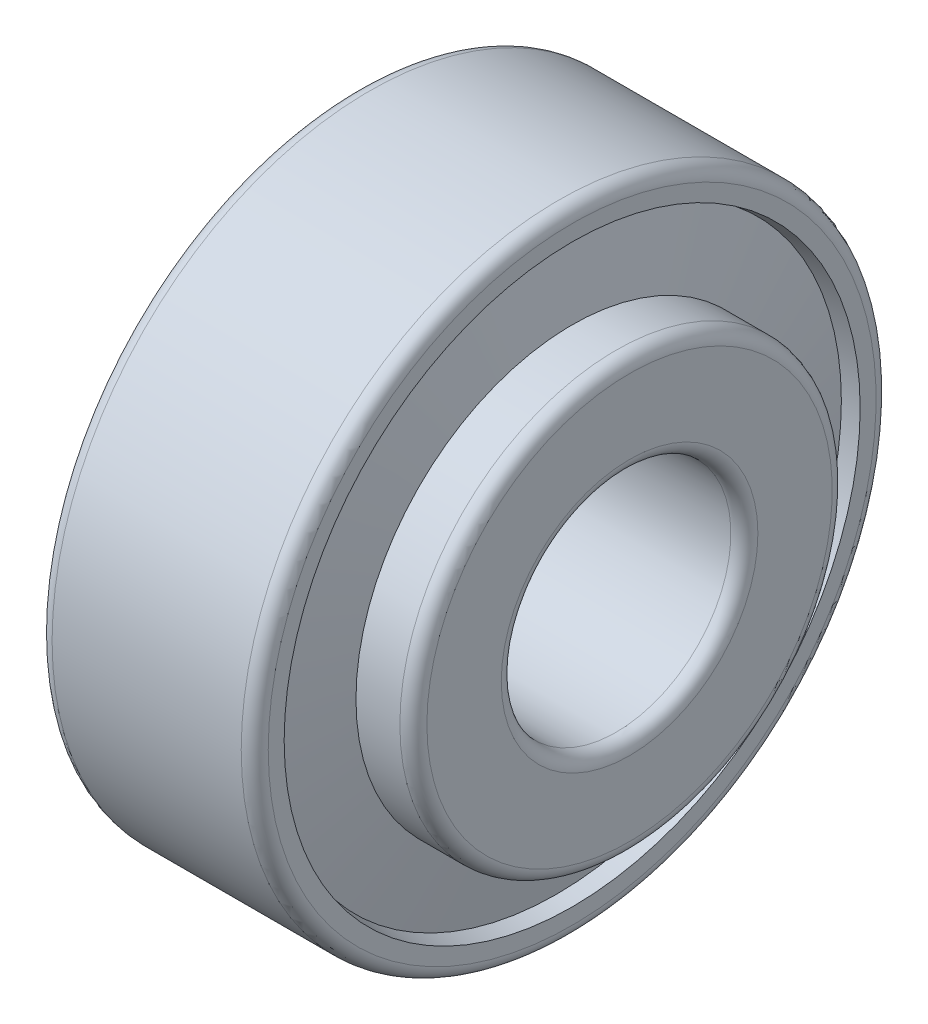
ISO-10303-21;
HEADER;
FILE_DESCRIPTION(('STEP AP214'),'2;1');
FILE_NAME('part.step','',(''),(''),'','','');
FILE_SCHEMA(('AUTOMOTIVE_DESIGN { 1 0 10303 214 1 1 1 1 }'));
ENDSEC;
DATA;
#1=APPLICATION_CONTEXT('core data for automotive mechanical design processes');
#2=APPLICATION_PROTOCOL_DEFINITION('international standard','automotive_design',2000,#1);
#3=PRODUCT_CONTEXT('',#1,'mechanical');
#4=PRODUCT('Part','Part','',(#3));
#5=PRODUCT_RELATED_PRODUCT_CATEGORY('part','',(#4));
#6=PRODUCT_DEFINITION_FORMATION('','',#4);
#7=PRODUCT_DEFINITION_CONTEXT('part definition',#1,'design');
#8=PRODUCT_DEFINITION('design','',#6,#7);
#9=PRODUCT_DEFINITION_SHAPE('','',#8);
#10=(LENGTH_UNIT() NAMED_UNIT(*) SI_UNIT(.MILLI.,.METRE.));
#11=(NAMED_UNIT(*) PLANE_ANGLE_UNIT() SI_UNIT($,.RADIAN.));
#12=(NAMED_UNIT(*) SI_UNIT($,.STERADIAN.) SOLID_ANGLE_UNIT());
#13=UNCERTAINTY_MEASURE_WITH_UNIT(LENGTH_MEASURE(1.E-05),#10,'distance_accuracy_value','');
#14=(GEOMETRIC_REPRESENTATION_CONTEXT(3) GLOBAL_UNCERTAINTY_ASSIGNED_CONTEXT((#13)) GLOBAL_UNIT_ASSIGNED_CONTEXT((#10,
#11,#12)) REPRESENTATION_CONTEXT('',''));
#15=CARTESIAN_POINT('',(0.,0.,0.));
#16=DIRECTION('',(0.,0.,1.));
#17=DIRECTION('',(1.,0.,0.));
#18=AXIS2_PLACEMENT_3D('',#15,#16,#17);
#19=CARTESIAN_POINT('',(2.33736788502514,0.,0.));
#20=DIRECTION('',(-1.,0.,0.));
#21=DIRECTION('',(0.,0.,1.));
#22=AXIS2_PLACEMENT_3D('',#19,#20,#21);
#23=CONICAL_SURFACE('',#22,18.5235776613116,1.38303283623799);
#24=CARTESIAN_POINT('',(3.4247357700502,0.,0.));
#25=DIRECTION('',(-1.,0.,0.));
#26=DIRECTION('',(0.,0.,1.));
#27=AXIS2_PLACEMENT_3D('',#24,#25,#26);
#28=CIRCLE('',#27,12.8006369794296);
#29=CARTESIAN_POINT('',(3.4247357700502,0.,12.8006369794296));
#30=VERTEX_POINT('',#29);
#31=EDGE_CURVE('E112',#30,#30,#28,.T.);
#32=ORIENTED_EDGE('',*,*,#31,.F.);
#33=EDGE_LOOP('',(#32));
#34=FACE_BOUND('',#33,.T.);
#35=CARTESIAN_POINT('',(2.33736788502514,0.,0.));
#36=DIRECTION('',(-1.,0.,0.));
#37=DIRECTION('',(0.,0.,1.));
#38=AXIS2_PLACEMENT_3D('',#35,#36,#37);
#39=CIRCLE('',#38,18.5235776613116);
#40=CARTESIAN_POINT('',(2.33736788502514,0.,18.5235776613116));
#41=VERTEX_POINT('',#40);
#42=EDGE_CURVE('E10',#41,#41,#39,.T.);
#43=ORIENTED_EDGE('',*,*,#42,.T.);
#44=EDGE_LOOP('',(#43));
#45=FACE_BOUND('',#44,.T.);
#46=ADVANCED_FACE('F37',(#34,#45),#23,.F.);
#47=CARTESIAN_POINT('',(0.,0.,0.));
#48=DIRECTION('',(1.,0.,0.));
#49=DIRECTION('',(0.,0.,-1.));
#50=AXIS2_PLACEMENT_3D('',#47,#48,#49);
#51=CONICAL_SURFACE('',#50,18.045,0.201959319208055);
#52=ORIENTED_EDGE('',*,*,#42,.F.);
#53=EDGE_LOOP('',(#52));
#54=FACE_BOUND('',#53,.T.);
#55=CARTESIAN_POINT('',(0.,0.,0.));
#56=DIRECTION('',(-1.,0.,0.));
#57=DIRECTION('',(0.,0.,1.));
#58=AXIS2_PLACEMENT_3D('',#55,#56,#57);
#59=CIRCLE('',#58,18.045);
#60=CARTESIAN_POINT('',(0.,0.,18.045));
#61=VERTEX_POINT('',#60);
#62=EDGE_CURVE('E44',#61,#61,#59,.T.);
#63=ORIENTED_EDGE('',*,*,#62,.T.);
#64=EDGE_LOOP('',(#63));
#65=FACE_BOUND('',#64,.T.);
#66=ADVANCED_FACE('F120',(#54,#65),#51,.F.);
#67=CARTESIAN_POINT('',(0.,18.045,0.));
#68=DIRECTION('',(1.,0.,0.));
#69=DIRECTION('',(0.,0.,-1.));
#70=AXIS2_PLACEMENT_3D('',#67,#68,#69);
#71=PLANE('',#70);
#72=ORIENTED_EDGE('',*,*,#62,.F.);
#73=EDGE_LOOP('',(#72));
#74=FACE_BOUND('',#73,.T.);
#75=CARTESIAN_POINT('',(0.,0.,0.));
#76=DIRECTION('',(-1.,0.,0.));
#77=DIRECTION('',(0.,0.,1.));
#78=AXIS2_PLACEMENT_3D('',#75,#76,#77);
#79=CIRCLE('',#78,22.5);
#80=CARTESIAN_POINT('',(0.,0.,22.5));
#81=VERTEX_POINT('',#80);
#82=EDGE_CURVE('E49',#81,#81,#79,.T.);
#83=ORIENTED_EDGE('',*,*,#82,.T.);
#84=EDGE_LOOP('',(#83));
#85=FACE_BOUND('',#84,.T.);
#86=ADVANCED_FACE('F124',(#74,#85),#71,.F.);
#87=CARTESIAN_POINT('',(1.,0.,0.));
#88=DIRECTION('',(-1.,0.,0.));
#89=DIRECTION('',(0.,0.,1.));
#90=AXIS2_PLACEMENT_3D('',#87,#88,#89);
#91=TOROIDAL_SURFACE('',#90,22.5,1.);
#92=ORIENTED_EDGE('',*,*,#82,.F.);
#93=EDGE_LOOP('',(#92));
#94=FACE_BOUND('',#93,.T.);
#95=CARTESIAN_POINT('',(1.,0.,0.));
#96=DIRECTION('',(-1.,0.,0.));
#97=DIRECTION('',(0.,0.,1.));
#98=AXIS2_PLACEMENT_3D('',#95,#96,#97);
#99=CIRCLE('',#98,23.5);
#100=CARTESIAN_POINT('',(1.,0.,23.5));
#101=VERTEX_POINT('',#100);
#102=EDGE_CURVE('E54',#101,#101,#99,.T.);
#103=ORIENTED_EDGE('',*,*,#102,.T.);
#104=EDGE_LOOP('',(#103));
#105=FACE_BOUND('',#104,.T.);
#106=ADVANCED_FACE('F129',(#94,#105),#91,.T.);
#107=CARTESIAN_POINT('',(-882.527700014444,0.,0.));
#108=DIRECTION('',(-1.,0.,0.));
#109=DIRECTION('',(0.,0.,1.));
#110=AXIS2_PLACEMENT_3D('',#107,#108,#109);
#111=CYLINDRICAL_SURFACE('',#110,23.5);
#112=ORIENTED_EDGE('',*,*,#102,.F.);
#113=EDGE_LOOP('',(#112));
#114=FACE_BOUND('',#113,.T.);
#115=CARTESIAN_POINT('',(15.,0.,0.));
#116=DIRECTION('',(-1.,0.,0.));
#117=DIRECTION('',(0.,0.,1.));
#118=AXIS2_PLACEMENT_3D('',#115,#116,#117);
#119=CIRCLE('',#118,23.5);
#120=CARTESIAN_POINT('',(15.,0.,23.5));
#121=VERTEX_POINT('',#120);
#122=EDGE_CURVE('E60',#121,#121,#119,.T.);
#123=ORIENTED_EDGE('',*,*,#122,.T.);
#124=EDGE_LOOP('',(#123));
#125=FACE_BOUND('',#124,.T.);
#126=ADVANCED_FACE('F135',(#114,#125),#111,.T.);
#127=CARTESIAN_POINT('',(15.,0.,0.));
#128=DIRECTION('',(-1.,0.,0.));
#129=DIRECTION('',(0.,0.,1.));
#130=AXIS2_PLACEMENT_3D('',#127,#128,#129);
#131=TOROIDAL_SURFACE('',#130,22.5,1.);
#132=ORIENTED_EDGE('',*,*,#122,.F.);
#133=EDGE_LOOP('',(#132));
#134=FACE_BOUND('',#133,.T.);
#135=CARTESIAN_POINT('',(16.,0.,0.));
#136=DIRECTION('',(-1.,0.,0.));
#137=DIRECTION('',(0.,0.,1.));
#138=AXIS2_PLACEMENT_3D('',#135,#136,#137);
#139=CIRCLE('',#138,22.5);
#140=CARTESIAN_POINT('',(16.,0.,22.5));
#141=VERTEX_POINT('',#140);
#142=EDGE_CURVE('E64',#141,#141,#139,.T.);
#143=ORIENTED_EDGE('',*,*,#142,.T.);
#144=EDGE_LOOP('',(#143));
#145=FACE_BOUND('',#144,.T.);
#146=ADVANCED_FACE('F139',(#134,#145),#131,.T.);
#147=CARTESIAN_POINT('',(16.,22.5,0.));
#148=DIRECTION('',(-1.,0.,0.));
#149=DIRECTION('',(0.,0.,1.));
#150=AXIS2_PLACEMENT_3D('',#147,#148,#149);
#151=PLANE('',#150);
#152=ORIENTED_EDGE('',*,*,#142,.F.);
#153=EDGE_LOOP('',(#152));
#154=FACE_BOUND('',#153,.T.);
#155=CARTESIAN_POINT('',(16.,0.,0.));
#156=DIRECTION('',(-1.,0.,0.));
#157=DIRECTION('',(0.,0.,1.));
#158=AXIS2_PLACEMENT_3D('',#155,#156,#157);
#159=CIRCLE('',#158,21.3210108624933);
#160=CARTESIAN_POINT('',(16.,0.,21.3210108624933));
#161=VERTEX_POINT('',#160);
#162=EDGE_CURVE('E68',#161,#161,#159,.T.);
#163=ORIENTED_EDGE('',*,*,#162,.T.);
#164=EDGE_LOOP('',(#163));
#165=FACE_BOUND('',#164,.T.);
#166=ADVANCED_FACE('F143',(#154,#165),#151,.F.);
#167=CARTESIAN_POINT('',(14.8449732976624,0.,0.));
#168=DIRECTION('',(1.,0.,0.));
#169=DIRECTION('',(0.,0.,-1.));
#170=AXIS2_PLACEMENT_3D('',#167,#168,#169);
#171=CONICAL_SURFACE('',#170,21.0845183610353,0.201959319208056);
#172=ORIENTED_EDGE('',*,*,#162,.F.);
#173=EDGE_LOOP('',(#172));
#174=FACE_BOUND('',#173,.T.);
#175=CARTESIAN_POINT('',(14.8449732976624,0.,0.));
#176=DIRECTION('',(-1.,0.,0.));
#177=DIRECTION('',(0.,0.,1.));
#178=AXIS2_PLACEMENT_3D('',#175,#176,#177);
#179=CIRCLE('',#178,21.0845183610353);
#180=CARTESIAN_POINT('',(14.8449732976624,0.,21.0845183610353));
#181=VERTEX_POINT('',#180);
#182=EDGE_CURVE('E72',#181,#181,#179,.T.);
#183=ORIENTED_EDGE('',*,*,#182,.T.);
#184=EDGE_LOOP('',(#183));
#185=FACE_BOUND('',#184,.T.);
#186=ADVANCED_FACE('F147',(#174,#185),#171,.F.);
#187=CARTESIAN_POINT('',(16.,0.,0.));
#188=DIRECTION('',(-1.,0.,0.));
#189=DIRECTION('',(0.,0.,1.));
#190=AXIS2_PLACEMENT_3D('',#187,#188,#189);
#191=CONICAL_SURFACE('',#190,15.0054816389647,1.38303283623799);
#192=ORIENTED_EDGE('',*,*,#182,.F.);
#193=EDGE_LOOP('',(#192));
#194=FACE_BOUND('',#193,.T.);
#195=CARTESIAN_POINT('',(16.,0.,0.));
#196=DIRECTION('',(-1.,0.,0.));
#197=DIRECTION('',(0.,0.,1.));
#198=AXIS2_PLACEMENT_3D('',#195,#196,#197);
#199=CIRCLE('',#198,15.0054816389647);
#200=CARTESIAN_POINT('',(16.,0.,15.0054816389647));
#201=VERTEX_POINT('',#200);
#202=EDGE_CURVE('E76',#201,#201,#199,.T.);
#203=ORIENTED_EDGE('',*,*,#202,.T.);
#204=EDGE_LOOP('',(#203));
#205=FACE_BOUND('',#204,.T.);
#206=ADVANCED_FACE('F151',(#194,#205),#191,.T.);
#207=CARTESIAN_POINT('',(16.,16.0054816389647,0.));
#208=DIRECTION('',(1.,0.,0.));
#209=DIRECTION('',(0.,0.,-1.));
#210=AXIS2_PLACEMENT_3D('',#207,#208,#209);
#211=PLANE('',#210);
#212=ORIENTED_EDGE('',*,*,#202,.F.);
#213=EDGE_LOOP('',(#212));
#214=FACE_BOUND('',#213,.T.);
#215=CARTESIAN_POINT('',(16.,0.,0.));
#216=DIRECTION('',(-1.,0.,0.));
#217=DIRECTION('',(0.,0.,1.));
#218=AXIS2_PLACEMENT_3D('',#215,#216,#217);
#219=CIRCLE('',#218,16.0054816389647);
#220=CARTESIAN_POINT('',(16.,0.,16.0054816389647));
#221=VERTEX_POINT('',#220);
#222=EDGE_CURVE('E80',#221,#221,#219,.T.);
#223=ORIENTED_EDGE('',*,*,#222,.T.);
#224=EDGE_LOOP('',(#223));
#225=FACE_BOUND('',#224,.T.);
#226=ADVANCED_FACE('F155',(#214,#225),#211,.F.);
#227=CARTESIAN_POINT('',(-882.527700014444,0.,0.));
#228=DIRECTION('',(-1.,0.,0.));
#229=DIRECTION('',(0.,0.,1.));
#230=AXIS2_PLACEMENT_3D('',#227,#228,#229);
#231=CYLINDRICAL_SURFACE('',#230,16.0054816389647);
#232=ORIENTED_EDGE('',*,*,#222,.F.);
#233=EDGE_LOOP('',(#232));
#234=FACE_BOUND('',#233,.T.);
#235=CARTESIAN_POINT('',(19.25,0.,0.));
#236=DIRECTION('',(-1.,0.,0.));
#237=DIRECTION('',(0.,0.,1.));
#238=AXIS2_PLACEMENT_3D('',#235,#236,#237);
#239=CIRCLE('',#238,16.0054816389647);
#240=CARTESIAN_POINT('',(19.25,0.,16.0054816389647));
#241=VERTEX_POINT('',#240);
#242=EDGE_CURVE('E84',#241,#241,#239,.T.);
#243=ORIENTED_EDGE('',*,*,#242,.T.);
#244=EDGE_LOOP('',(#243));
#245=FACE_BOUND('',#244,.T.);
#246=ADVANCED_FACE('F159',(#234,#245),#231,.T.);
#247=CARTESIAN_POINT('',(19.25,0.,0.));
#248=DIRECTION('',(-1.,0.,0.));
#249=DIRECTION('',(0.,0.,1.));
#250=AXIS2_PLACEMENT_3D('',#247,#248,#249);
#251=TOROIDAL_SURFACE('',#250,15.0054816389647,1.);
#252=ORIENTED_EDGE('',*,*,#242,.F.);
#253=EDGE_LOOP('',(#252));
#254=FACE_BOUND('',#253,.T.);
#255=CARTESIAN_POINT('',(20.25,0.,0.));
#256=DIRECTION('',(-1.,0.,0.));
#257=DIRECTION('',(0.,0.,1.));
#258=AXIS2_PLACEMENT_3D('',#255,#256,#257);
#259=CIRCLE('',#258,15.0054816389647);
#260=CARTESIAN_POINT('',(20.25,0.,15.0054816389647));
#261=VERTEX_POINT('',#260);
#262=EDGE_CURVE('E88',#261,#261,#259,.T.);
#263=ORIENTED_EDGE('',*,*,#262,.T.);
#264=EDGE_LOOP('',(#263));
#265=FACE_BOUND('',#264,.T.);
#266=ADVANCED_FACE('F163',(#254,#265),#251,.T.);
#267=CARTESIAN_POINT('',(20.25,9.5,0.));
#268=DIRECTION('',(-1.,0.,0.));
#269=DIRECTION('',(0.,0.,1.));
#270=AXIS2_PLACEMENT_3D('',#267,#268,#269);
#271=PLANE('',#270);
#272=ORIENTED_EDGE('',*,*,#262,.F.);
#273=EDGE_LOOP('',(#272));
#274=FACE_BOUND('',#273,.T.);
#275=CARTESIAN_POINT('',(20.25,0.,0.));
#276=DIRECTION('',(-1.,0.,0.));
#277=DIRECTION('',(0.,0.,1.));
#278=AXIS2_PLACEMENT_3D('',#275,#276,#277);
#279=CIRCLE('',#278,9.5);
#280=CARTESIAN_POINT('',(20.25,0.,9.5));
#281=VERTEX_POINT('',#280);
#282=EDGE_CURVE('E92',#281,#281,#279,.T.);
#283=ORIENTED_EDGE('',*,*,#282,.T.);
#284=EDGE_LOOP('',(#283));
#285=FACE_BOUND('',#284,.T.);
#286=ADVANCED_FACE('F167',(#274,#285),#271,.F.);
#287=CARTESIAN_POINT('',(19.25,0.,0.));
#288=DIRECTION('',(-1.,0.,0.));
#289=DIRECTION('',(0.,0.,1.));
#290=AXIS2_PLACEMENT_3D('',#287,#288,#289);
#291=TOROIDAL_SURFACE('',#290,9.5,1.);
#292=ORIENTED_EDGE('',*,*,#282,.F.);
#293=EDGE_LOOP('',(#292));
#294=FACE_BOUND('',#293,.T.);
#295=CARTESIAN_POINT('',(19.25,0.,0.));
#296=DIRECTION('',(-1.,0.,0.));
#297=DIRECTION('',(0.,0.,1.));
#298=AXIS2_PLACEMENT_3D('',#295,#296,#297);
#299=CIRCLE('',#298,8.5);
#300=CARTESIAN_POINT('',(19.25,0.,8.5));
#301=VERTEX_POINT('',#300);
#302=EDGE_CURVE('E96',#301,#301,#299,.T.);
#303=ORIENTED_EDGE('',*,*,#302,.T.);
#304=EDGE_LOOP('',(#303));
#305=FACE_BOUND('',#304,.T.);
#306=ADVANCED_FACE('F171',(#294,#305),#291,.T.);
#307=CARTESIAN_POINT('',(-882.527700014444,0.,0.));
#308=DIRECTION('',(-1.,0.,0.));
#309=DIRECTION('',(0.,0.,1.));
#310=AXIS2_PLACEMENT_3D('',#307,#308,#309);
#311=CYLINDRICAL_SURFACE('',#310,8.5);
#312=ORIENTED_EDGE('',*,*,#302,.F.);
#313=EDGE_LOOP('',(#312));
#314=FACE_BOUND('',#313,.T.);
#315=CARTESIAN_POINT('',(2.24999999999997,0.,0.));
#316=DIRECTION('',(-1.,0.,0.));
#317=DIRECTION('',(0.,0.,1.));
#318=AXIS2_PLACEMENT_3D('',#315,#316,#317);
#319=CIRCLE('',#318,8.5);
#320=CARTESIAN_POINT('',(2.24999999999997,0.,8.5));
#321=VERTEX_POINT('',#320);
#322=EDGE_CURVE('E100',#321,#321,#319,.T.);
#323=ORIENTED_EDGE('',*,*,#322,.T.);
#324=EDGE_LOOP('',(#323));
#325=FACE_BOUND('',#324,.T.);
#326=ADVANCED_FACE('F175',(#314,#325),#311,.F.);
#327=CARTESIAN_POINT('',(2.25,0.,0.));
#328=DIRECTION('',(-1.,0.,0.));
#329=DIRECTION('',(0.,0.,1.));
#330=AXIS2_PLACEMENT_3D('',#327,#328,#329);
#331=TOROIDAL_SURFACE('',#330,9.5,1.);
#332=ORIENTED_EDGE('',*,*,#322,.F.);
#333=EDGE_LOOP('',(#332));
#334=FACE_BOUND('',#333,.T.);
#335=CARTESIAN_POINT('',(1.24999999999997,0.,0.));
#336=DIRECTION('',(-1.,0.,0.));
#337=DIRECTION('',(0.,0.,1.));
#338=AXIS2_PLACEMENT_3D('',#335,#336,#337);
#339=CIRCLE('',#338,9.5);
#340=CARTESIAN_POINT('',(1.24999999999997,0.,9.5));
#341=VERTEX_POINT('',#340);
#342=EDGE_CURVE('E104',#341,#341,#339,.T.);
#343=ORIENTED_EDGE('',*,*,#342,.T.);
#344=EDGE_LOOP('',(#343));
#345=FACE_BOUND('',#344,.T.);
#346=ADVANCED_FACE('F179',(#334,#345),#331,.T.);
#347=CARTESIAN_POINT('',(1.25,12.8006369794296,0.));
#348=DIRECTION('',(1.,0.,0.));
#349=DIRECTION('',(0.,0.,-1.));
#350=AXIS2_PLACEMENT_3D('',#347,#348,#349);
#351=PLANE('',#350);
#352=ORIENTED_EDGE('',*,*,#342,.F.);
#353=EDGE_LOOP('',(#352));
#354=FACE_BOUND('',#353,.T.);
#355=CARTESIAN_POINT('',(1.24999999999997,0.,0.));
#356=DIRECTION('',(-1.,0.,0.));
#357=DIRECTION('',(0.,0.,1.));
#358=AXIS2_PLACEMENT_3D('',#355,#356,#357);
#359=CIRCLE('',#358,12.8006369794296);
#360=CARTESIAN_POINT('',(1.24999999999997,0.,12.8006369794296));
#361=VERTEX_POINT('',#360);
#362=EDGE_CURVE('E108',#361,#361,#359,.T.);
#363=ORIENTED_EDGE('',*,*,#362,.T.);
#364=EDGE_LOOP('',(#363));
#365=FACE_BOUND('',#364,.T.);
#366=ADVANCED_FACE('F183',(#354,#365),#351,.F.);
#367=CARTESIAN_POINT('',(-882.527700014444,0.,0.));
#368=DIRECTION('',(-1.,0.,0.));
#369=DIRECTION('',(0.,0.,1.));
#370=AXIS2_PLACEMENT_3D('',#367,#368,#369);
#371=CYLINDRICAL_SURFACE('',#370,12.8006369794296);
#372=ORIENTED_EDGE('',*,*,#362,.F.);
#373=EDGE_LOOP('',(#372));
#374=FACE_BOUND('',#373,.T.);
#375=ORIENTED_EDGE('',*,*,#31,.T.);
#376=EDGE_LOOP('',(#375));
#377=FACE_BOUND('',#376,.T.);
#378=ADVANCED_FACE('F117',(#374,#377),#371,.T.);
#379=CLOSED_SHELL('',(#46,#66,#86,#106,#126,#146,#166,#186,#206,#226,#246,#266,#286,#306,#326,
#346,#366,#378));
#380=MANIFOLD_SOLID_BREP('B2',#379);
#381=ADVANCED_BREP_SHAPE_REPRESENTATION('',(#18,#380),#14);
#382=SHAPE_DEFINITION_REPRESENTATION(#9,#381);
ENDSEC;
END-ISO-10303-21;
